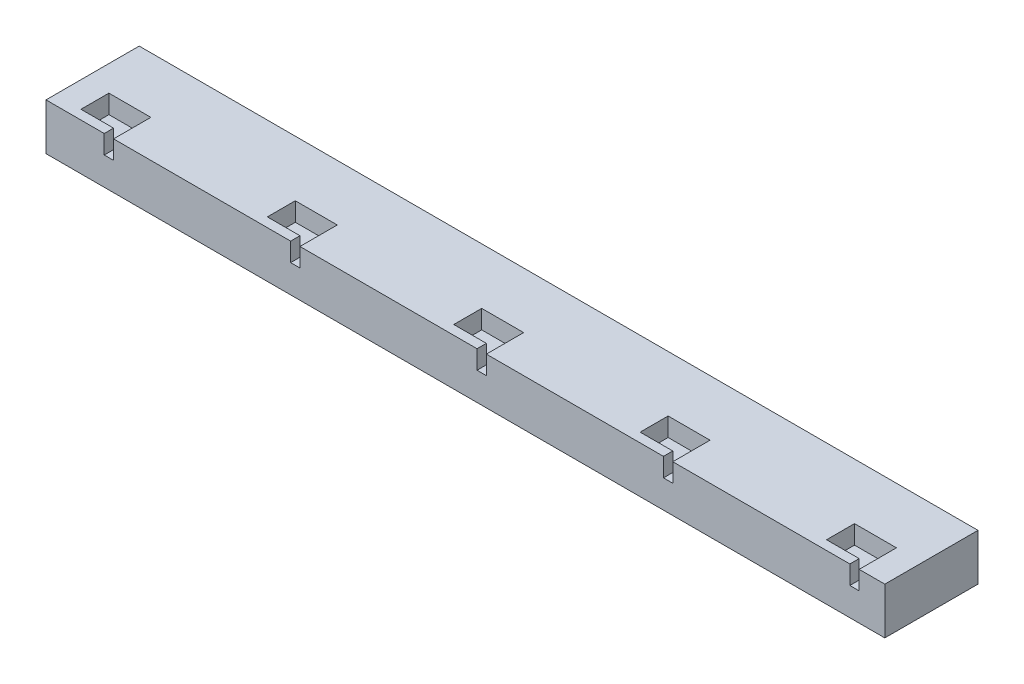
ISO-10303-21;
HEADER;
FILE_DESCRIPTION(('STEP AP214'),'2;1');
FILE_NAME('part.step','',(''),(''),'','','');
FILE_SCHEMA(('AUTOMOTIVE_DESIGN { 1 0 10303 214 1 1 1 1 }'));
ENDSEC;
DATA;
#1=APPLICATION_CONTEXT('core data for automotive mechanical design processes');
#2=APPLICATION_PROTOCOL_DEFINITION('international standard','automotive_design',2000,#1);
#3=PRODUCT_CONTEXT('',#1,'mechanical');
#4=PRODUCT('Part','Part','',(#3));
#5=PRODUCT_RELATED_PRODUCT_CATEGORY('part','',(#4));
#6=PRODUCT_DEFINITION_FORMATION('','',#4);
#7=PRODUCT_DEFINITION_CONTEXT('part definition',#1,'design');
#8=PRODUCT_DEFINITION('design','',#6,#7);
#9=PRODUCT_DEFINITION_SHAPE('','',#8);
#10=(LENGTH_UNIT() NAMED_UNIT(*) SI_UNIT(.MILLI.,.METRE.));
#11=(NAMED_UNIT(*) PLANE_ANGLE_UNIT() SI_UNIT($,.RADIAN.));
#12=(NAMED_UNIT(*) SI_UNIT($,.STERADIAN.) SOLID_ANGLE_UNIT());
#13=UNCERTAINTY_MEASURE_WITH_UNIT(LENGTH_MEASURE(1.E-05),#10,'distance_accuracy_value','');
#14=(GEOMETRIC_REPRESENTATION_CONTEXT(3) GLOBAL_UNCERTAINTY_ASSIGNED_CONTEXT((#13)) GLOBAL_UNIT_ASSIGNED_CONTEXT((#10,
#11,#12)) REPRESENTATION_CONTEXT('',''));
#15=CARTESIAN_POINT('',(0.,0.,0.));
#16=DIRECTION('',(0.,0.,1.));
#17=DIRECTION('',(1.,0.,0.));
#18=AXIS2_PLACEMENT_3D('',#15,#16,#17);
#19=CARTESIAN_POINT('',(90.0000000000001,10.,10.));
#20=DIRECTION('',(-1.,0.,0.));
#21=DIRECTION('',(0.,0.,1.));
#22=AXIS2_PLACEMENT_3D('',#19,#20,#21);
#23=PLANE('',#22);
#24=DIRECTION('',(0.,0.,-1.));
#25=VECTOR('',#24,1.);
#26=CARTESIAN_POINT('',(90.0000000000001,0.,10.));
#27=LINE('',#26,#25);
#28=CARTESIAN_POINT('',(90.0000000000001,0.,10.));
#29=VERTEX_POINT('',#28);
#30=CARTESIAN_POINT('',(90.0000000000001,0.,-10.));
#31=VERTEX_POINT('',#30);
#32=EDGE_CURVE('E467',#29,#31,#27,.T.);
#33=ORIENTED_EDGE('',*,*,#32,.T.);
#34=DIRECTION('',(0.,-1.,0.));
#35=VECTOR('',#34,1.);
#36=CARTESIAN_POINT('',(90.0000000000001,10.,-10.));
#37=LINE('',#36,#35);
#38=CARTESIAN_POINT('',(90.0000000000001,10.,-10.));
#39=VERTEX_POINT('',#38);
#40=EDGE_CURVE('E11',#39,#31,#37,.T.);
#41=ORIENTED_EDGE('',*,*,#40,.F.);
#42=DIRECTION('',(0.,0.,-1.));
#43=VECTOR('',#42,1.);
#44=CARTESIAN_POINT('',(90.0000000000001,10.,10.));
#45=LINE('',#44,#43);
#46=CARTESIAN_POINT('',(90.0000000000001,10.,10.));
#47=VERTEX_POINT('',#46);
#48=EDGE_CURVE('E479',#47,#39,#45,.T.);
#49=ORIENTED_EDGE('',*,*,#48,.F.);
#50=DIRECTION('',(0.,-1.,0.));
#51=VECTOR('',#50,1.);
#52=CARTESIAN_POINT('',(90.0000000000001,10.,10.));
#53=LINE('',#52,#51);
#54=EDGE_CURVE('E491',#47,#29,#53,.T.);
#55=ORIENTED_EDGE('',*,*,#54,.T.);
#56=EDGE_LOOP('',(#33,#41,#49,#55));
#57=FACE_BOUND('',#56,.T.);
#58=ADVANCED_FACE('F41',(#57),#23,.F.);
#59=CARTESIAN_POINT('',(-89.9999999999999,10.,-10.));
#60=DIRECTION('',(0.,0.,1.));
#61=DIRECTION('',(1.,0.,0.));
#62=AXIS2_PLACEMENT_3D('',#59,#60,#61);
#63=PLANE('',#62);
#64=DIRECTION('',(-1.,0.,0.));
#65=VECTOR('',#64,1.);
#66=CARTESIAN_POINT('',(-89.9999999999999,0.,-10.));
#67=LINE('',#66,#65);
#68=CARTESIAN_POINT('',(-89.9999999999999,0.,-10.));
#69=VERTEX_POINT('',#68);
#70=EDGE_CURVE('E495',#31,#69,#67,.T.);
#71=ORIENTED_EDGE('',*,*,#70,.T.);
#72=DIRECTION('',(0.,-1.,0.));
#73=VECTOR('',#72,1.);
#74=CARTESIAN_POINT('',(-89.9999999999999,10.,-10.));
#75=LINE('',#74,#73);
#76=CARTESIAN_POINT('',(-89.9999999999999,10.,-10.));
#77=VERTEX_POINT('',#76);
#78=EDGE_CURVE('E48',#77,#69,#75,.T.);
#79=ORIENTED_EDGE('',*,*,#78,.F.);
#80=DIRECTION('',(-1.,0.,0.));
#81=VECTOR('',#80,1.);
#82=CARTESIAN_POINT('',(-89.9999999999999,10.,-10.));
#83=LINE('',#82,#81);
#84=EDGE_CURVE('E482',#39,#77,#83,.T.);
#85=ORIENTED_EDGE('',*,*,#84,.F.);
#86=ORIENTED_EDGE('',*,*,#40,.T.);
#87=EDGE_LOOP('',(#71,#79,#85,#86));
#88=FACE_BOUND('',#87,.T.);
#89=ADVANCED_FACE('F641',(#88),#63,.F.);
#90=CARTESIAN_POINT('',(-89.9999999999999,10.,10.));
#91=DIRECTION('',(1.,0.,0.));
#92=DIRECTION('',(0.,0.,-1.));
#93=AXIS2_PLACEMENT_3D('',#90,#91,#92);
#94=PLANE('',#93);
#95=DIRECTION('',(0.,0.,1.));
#96=VECTOR('',#95,1.);
#97=CARTESIAN_POINT('',(-89.9999999999999,0.,10.));
#98=LINE('',#97,#96);
#99=CARTESIAN_POINT('',(-89.9999999999999,0.,10.));
#100=VERTEX_POINT('',#99);
#101=EDGE_CURVE('E497',#69,#100,#98,.T.);
#102=ORIENTED_EDGE('',*,*,#101,.T.);
#103=DIRECTION('',(0.,-1.,0.));
#104=VECTOR('',#103,1.);
#105=CARTESIAN_POINT('',(-89.9999999999999,10.,10.));
#106=LINE('',#105,#104);
#107=CARTESIAN_POINT('',(-89.9999999999999,10.,10.));
#108=VERTEX_POINT('',#107);
#109=EDGE_CURVE('E502',#108,#100,#106,.T.);
#110=ORIENTED_EDGE('',*,*,#109,.F.);
#111=DIRECTION('',(0.,0.,1.));
#112=VECTOR('',#111,1.);
#113=CARTESIAN_POINT('',(-89.9999999999999,10.,10.));
#114=LINE('',#113,#112);
#115=EDGE_CURVE('E485',#77,#108,#114,.T.);
#116=ORIENTED_EDGE('',*,*,#115,.F.);
#117=ORIENTED_EDGE('',*,*,#78,.T.);
#118=EDGE_LOOP('',(#102,#110,#116,#117));
#119=FACE_BOUND('',#118,.T.);
#120=ADVANCED_FACE('F509',(#119),#94,.F.);
#121=CARTESIAN_POINT('',(-89.9999999999999,10.,10.));
#122=DIRECTION('',(0.,0.,-1.));
#123=DIRECTION('',(-1.,0.,0.));
#124=AXIS2_PLACEMENT_3D('',#121,#122,#123);
#125=PLANE('',#124);
#126=DIRECTION('',(1.,0.,0.));
#127=VECTOR('',#126,1.);
#128=CARTESIAN_POINT('',(-89.9999999999999,10.,10.));
#129=LINE('',#128,#127);
#130=CARTESIAN_POINT('',(-75.5,10.,10.0000000000011));
#131=VERTEX_POINT('',#130);
#132=CARTESIAN_POINT('',(-37.5,10.,10.0000000000008));
#133=VERTEX_POINT('',#132);
#134=EDGE_CURVE('E492',#131,#133,#129,.T.);
#135=ORIENTED_EDGE('',*,*,#134,.F.);
#136=DIRECTION('',(0.,1.,0.));
#137=VECTOR('',#136,1.);
#138=CARTESIAN_POINT('',(-75.5,6.,10.0000000000011));
#139=LINE('',#138,#137);
#140=CARTESIAN_POINT('',(-75.5,6.,10.0000000000011));
#141=VERTEX_POINT('',#140);
#142=EDGE_CURVE('E405',#141,#131,#139,.T.);
#143=ORIENTED_EDGE('',*,*,#142,.F.);
#144=DIRECTION('',(1.,0.,0.));
#145=VECTOR('',#144,1.);
#146=CARTESIAN_POINT('',(-75.5,6.,10.0000000000011));
#147=LINE('',#146,#145);
#148=CARTESIAN_POINT('',(-77.5,6.,10.0000000000011));
#149=VERTEX_POINT('',#148);
#150=EDGE_CURVE('E423',#149,#141,#147,.T.);
#151=ORIENTED_EDGE('',*,*,#150,.F.);
#152=DIRECTION('',(0.,1.,0.));
#153=VECTOR('',#152,1.);
#154=CARTESIAN_POINT('',(-77.5,6.,10.0000000000011));
#155=LINE('',#154,#153);
#156=CARTESIAN_POINT('',(-77.5,10.,10.0000000000011));
#157=VERTEX_POINT('',#156);
#158=EDGE_CURVE('E402',#149,#157,#155,.T.);
#159=ORIENTED_EDGE('',*,*,#158,.T.);
#160=EDGE_CURVE('E488',#108,#157,#129,.T.);
#161=ORIENTED_EDGE('',*,*,#160,.F.);
#162=ORIENTED_EDGE('',*,*,#109,.T.);
#163=DIRECTION('',(1.,0.,0.));
#164=VECTOR('',#163,1.);
#165=CARTESIAN_POINT('',(-89.9999999999999,0.,10.));
#166=LINE('',#165,#164);
#167=EDGE_CURVE('E483',#100,#29,#166,.T.);
#168=ORIENTED_EDGE('',*,*,#167,.T.);
#169=ORIENTED_EDGE('',*,*,#54,.F.);
#170=CARTESIAN_POINT('',(84.5,10.,10.));
#171=VERTEX_POINT('',#170);
#172=EDGE_CURVE('E487',#171,#47,#129,.T.);
#173=ORIENTED_EDGE('',*,*,#172,.F.);
#174=DIRECTION('',(0.,1.,0.));
#175=VECTOR('',#174,1.);
#176=CARTESIAN_POINT('',(84.5,6.,10.));
#177=LINE('',#176,#175);
#178=CARTESIAN_POINT('',(84.5,6.,10.));
#179=VERTEX_POINT('',#178);
#180=EDGE_CURVE('E270',#179,#171,#177,.T.);
#181=ORIENTED_EDGE('',*,*,#180,.F.);
#182=DIRECTION('',(1.,0.,0.));
#183=VECTOR('',#182,1.);
#184=CARTESIAN_POINT('',(84.5,6.,10.));
#185=LINE('',#184,#183);
#186=CARTESIAN_POINT('',(82.5,6.,10.));
#187=VERTEX_POINT('',#186);
#188=EDGE_CURVE('E296',#187,#179,#185,.T.);
#189=ORIENTED_EDGE('',*,*,#188,.F.);
#190=DIRECTION('',(0.,1.,0.));
#191=VECTOR('',#190,1.);
#192=CARTESIAN_POINT('',(82.5,6.,10.));
#193=LINE('',#192,#191);
#194=CARTESIAN_POINT('',(82.5,10.,10.));
#195=VERTEX_POINT('',#194);
#196=EDGE_CURVE('E610',#187,#195,#193,.T.);
#197=ORIENTED_EDGE('',*,*,#196,.T.);
#198=CARTESIAN_POINT('',(44.5,10.,10.0000000000003));
#199=VERTEX_POINT('',#198);
#200=EDGE_CURVE('E524',#199,#195,#129,.T.);
#201=ORIENTED_EDGE('',*,*,#200,.F.);
#202=DIRECTION('',(0.,1.,0.));
#203=VECTOR('',#202,1.);
#204=CARTESIAN_POINT('',(44.5,6.,10.0000000000003));
#205=LINE('',#204,#203);
#206=CARTESIAN_POINT('',(44.5,6.,10.0000000000003));
#207=VERTEX_POINT('',#206);
#208=EDGE_CURVE('E468',#207,#199,#205,.T.);
#209=ORIENTED_EDGE('',*,*,#208,.F.);
#210=DIRECTION('',(1.,0.,0.));
#211=VECTOR('',#210,1.);
#212=CARTESIAN_POINT('',(44.5,6.,10.0000000000003));
#213=LINE('',#212,#211);
#214=CARTESIAN_POINT('',(42.5,6.,10.0000000000003));
#215=VERTEX_POINT('',#214);
#216=EDGE_CURVE('E450',#215,#207,#213,.T.);
#217=ORIENTED_EDGE('',*,*,#216,.F.);
#218=DIRECTION('',(0.,1.,0.));
#219=VECTOR('',#218,1.);
#220=CARTESIAN_POINT('',(42.5,6.,10.0000000000003));
#221=LINE('',#220,#219);
#222=CARTESIAN_POINT('',(42.5,10.,10.0000000000003));
#223=VERTEX_POINT('',#222);
#224=EDGE_CURVE('E470',#215,#223,#221,.T.);
#225=ORIENTED_EDGE('',*,*,#224,.T.);
#226=CARTESIAN_POINT('',(4.50000000000002,10.,10.0000000000006));
#227=VERTEX_POINT('',#226);
#228=EDGE_CURVE('E526',#227,#223,#129,.T.);
#229=ORIENTED_EDGE('',*,*,#228,.F.);
#230=DIRECTION('',(0.,1.,0.));
#231=VECTOR('',#230,1.);
#232=CARTESIAN_POINT('',(4.50000000000002,6.,10.0000000000006));
#233=LINE('',#232,#231);
#234=CARTESIAN_POINT('',(4.50000000000002,6.,10.0000000000006));
#235=VERTEX_POINT('',#234);
#236=EDGE_CURVE('E321',#235,#227,#233,.T.);
#237=ORIENTED_EDGE('',*,*,#236,.F.);
#238=DIRECTION('',(1.,0.,0.));
#239=VECTOR('',#238,1.);
#240=CARTESIAN_POINT('',(4.50000000000002,6.,10.0000000000006));
#241=LINE('',#240,#239);
#242=CARTESIAN_POINT('',(2.50000000000002,6.,10.0000000000006));
#243=VERTEX_POINT('',#242);
#244=EDGE_CURVE('E339',#243,#235,#241,.T.);
#245=ORIENTED_EDGE('',*,*,#244,.F.);
#246=DIRECTION('',(0.,1.,0.));
#247=VECTOR('',#246,1.);
#248=CARTESIAN_POINT('',(2.50000000000002,6.,10.0000000000006));
#249=LINE('',#248,#247);
#250=CARTESIAN_POINT('',(2.50000000000002,10.,10.0000000000006));
#251=VERTEX_POINT('',#250);
#252=EDGE_CURVE('E318',#243,#251,#249,.T.);
#253=ORIENTED_EDGE('',*,*,#252,.T.);
#254=CARTESIAN_POINT('',(-35.5,10.,10.0000000000008));
#255=VERTEX_POINT('',#254);
#256=EDGE_CURVE('E531',#255,#251,#129,.T.);
#257=ORIENTED_EDGE('',*,*,#256,.F.);
#258=DIRECTION('',(0.,1.,0.));
#259=VECTOR('',#258,1.);
#260=CARTESIAN_POINT('',(-35.5,6.,10.0000000000008));
#261=LINE('',#260,#259);
#262=CARTESIAN_POINT('',(-35.5,6.,10.0000000000008));
#263=VERTEX_POINT('',#262);
#264=EDGE_CURVE('E363',#263,#255,#261,.T.);
#265=ORIENTED_EDGE('',*,*,#264,.F.);
#266=DIRECTION('',(1.,0.,0.));
#267=VECTOR('',#266,1.);
#268=CARTESIAN_POINT('',(-35.5,6.,10.0000000000008));
#269=LINE('',#268,#267);
#270=CARTESIAN_POINT('',(-37.5,6.,10.0000000000008));
#271=VERTEX_POINT('',#270);
#272=EDGE_CURVE('E381',#271,#263,#269,.T.);
#273=ORIENTED_EDGE('',*,*,#272,.F.);
#274=DIRECTION('',(0.,1.,0.));
#275=VECTOR('',#274,1.);
#276=CARTESIAN_POINT('',(-37.5,6.,10.0000000000008));
#277=LINE('',#276,#275);
#278=EDGE_CURVE('E360',#271,#133,#277,.T.);
#279=ORIENTED_EDGE('',*,*,#278,.T.);
#280=EDGE_LOOP('',(#135,#143,#151,#159,#161,#162,#168,#169,#173,#181,#189,#197,#201,#209,#217,
#225,#229,#237,#245,#253,#257,#265,#273,#279));
#281=FACE_BOUND('',#280,.T.);
#282=ADVANCED_FACE('F519',(#281),#125,.F.);
#283=CARTESIAN_POINT('',(0.,10.,0.));
#284=DIRECTION('',(0.,-1.,0.));
#285=DIRECTION('',(0.,0.,-1.));
#286=AXIS2_PLACEMENT_3D('',#283,#284,#285);
#287=PLANE('',#286);
#288=DIRECTION('',(-1.,0.,0.));
#289=VECTOR('',#288,1.);
#290=CARTESIAN_POINT('',(-75.5,10.,2.00000000000112));
#291=LINE('',#290,#289);
#292=CARTESIAN_POINT('',(-75.5,10.,2.00000000000112));
#293=VERTEX_POINT('',#292);
#294=CARTESIAN_POINT('',(-84.5,10.,2.00000000000112));
#295=VERTEX_POINT('',#294);
#296=EDGE_CURVE('E55',#293,#295,#291,.T.);
#297=ORIENTED_EDGE('',*,*,#296,.F.);
#298=DIRECTION('',(0.,0.,-1.));
#299=VECTOR('',#298,1.);
#300=CARTESIAN_POINT('',(-75.5,10.,2.00000000000112));
#301=LINE('',#300,#299);
#302=EDGE_CURVE('E409',#131,#293,#301,.T.);
#303=ORIENTED_EDGE('',*,*,#302,.F.);
#304=ORIENTED_EDGE('',*,*,#134,.T.);
#305=DIRECTION('',(0.,0.,1.));
#306=VECTOR('',#305,1.);
#307=CARTESIAN_POINT('',(-37.5,10.,8.0000000000014));
#308=LINE('',#307,#306);
#309=CARTESIAN_POINT('',(-37.5,10.,8.0000000000014));
#310=VERTEX_POINT('',#309);
#311=EDGE_CURVE('E370',#310,#133,#308,.T.);
#312=ORIENTED_EDGE('',*,*,#311,.F.);
#313=DIRECTION('',(1.,0.,0.));
#314=VECTOR('',#313,1.);
#315=CARTESIAN_POINT('',(-37.5,10.,8.0000000000014));
#316=LINE('',#315,#314);
#317=CARTESIAN_POINT('',(-44.5,10.,8.0000000000014));
#318=VERTEX_POINT('',#317);
#319=EDGE_CURVE('E373',#318,#310,#316,.T.);
#320=ORIENTED_EDGE('',*,*,#319,.F.);
#321=DIRECTION('',(0.,0.,1.));
#322=VECTOR('',#321,1.);
#323=CARTESIAN_POINT('',(-44.5,10.,2.00000000000084));
#324=LINE('',#323,#322);
#325=CARTESIAN_POINT('',(-44.5,10.,2.00000000000084));
#326=VERTEX_POINT('',#325);
#327=EDGE_CURVE('E376',#326,#318,#324,.T.);
#328=ORIENTED_EDGE('',*,*,#327,.F.);
#329=DIRECTION('',(-1.,0.,0.));
#330=VECTOR('',#329,1.);
#331=CARTESIAN_POINT('',(-35.5,10.,2.00000000000084));
#332=LINE('',#331,#330);
#333=CARTESIAN_POINT('',(-35.5,10.,2.00000000000084));
#334=VERTEX_POINT('',#333);
#335=EDGE_CURVE('E63',#334,#326,#332,.T.);
#336=ORIENTED_EDGE('',*,*,#335,.F.);
#337=DIRECTION('',(0.,0.,-1.));
#338=VECTOR('',#337,1.);
#339=CARTESIAN_POINT('',(-35.5,10.,2.00000000000084));
#340=LINE('',#339,#338);
#341=EDGE_CURVE('E367',#255,#334,#340,.T.);
#342=ORIENTED_EDGE('',*,*,#341,.F.);
#343=ORIENTED_EDGE('',*,*,#256,.T.);
#344=DIRECTION('',(0.,0.,1.));
#345=VECTOR('',#344,1.);
#346=CARTESIAN_POINT('',(2.50000000000002,10.,8.00000000000112));
#347=LINE('',#346,#345);
#348=CARTESIAN_POINT('',(2.50000000000002,10.,8.00000000000112));
#349=VERTEX_POINT('',#348);
#350=EDGE_CURVE('E328',#349,#251,#347,.T.);
#351=ORIENTED_EDGE('',*,*,#350,.F.);
#352=DIRECTION('',(1.,0.,0.));
#353=VECTOR('',#352,1.);
#354=CARTESIAN_POINT('',(2.50000000000002,10.,8.00000000000112));
#355=LINE('',#354,#353);
#356=CARTESIAN_POINT('',(-4.49999999999999,10.,8.00000000000112));
#357=VERTEX_POINT('',#356);
#358=EDGE_CURVE('E331',#357,#349,#355,.T.);
#359=ORIENTED_EDGE('',*,*,#358,.F.);
#360=DIRECTION('',(0.,0.,1.));
#361=VECTOR('',#360,1.);
#362=CARTESIAN_POINT('',(-4.49999999999999,10.,2.00000000000056));
#363=LINE('',#362,#361);
#364=CARTESIAN_POINT('',(-4.49999999999999,10.,2.00000000000056));
#365=VERTEX_POINT('',#364);
#366=EDGE_CURVE('E334',#365,#357,#363,.T.);
#367=ORIENTED_EDGE('',*,*,#366,.F.);
#368=DIRECTION('',(-1.,0.,0.));
#369=VECTOR('',#368,1.);
#370=CARTESIAN_POINT('',(4.50000000000002,10.,2.00000000000056));
#371=LINE('',#370,#369);
#372=CARTESIAN_POINT('',(4.50000000000002,10.,2.00000000000056));
#373=VERTEX_POINT('',#372);
#374=EDGE_CURVE('E271',#373,#365,#371,.T.);
#375=ORIENTED_EDGE('',*,*,#374,.F.);
#376=DIRECTION('',(0.,0.,-1.));
#377=VECTOR('',#376,1.);
#378=CARTESIAN_POINT('',(4.50000000000002,10.,2.00000000000056));
#379=LINE('',#378,#377);
#380=EDGE_CURVE('E325',#227,#373,#379,.T.);
#381=ORIENTED_EDGE('',*,*,#380,.F.);
#382=ORIENTED_EDGE('',*,*,#228,.T.);
#383=DIRECTION('',(0.,0.,1.));
#384=VECTOR('',#383,1.);
#385=CARTESIAN_POINT('',(42.5,10.,8.00000000000084));
#386=LINE('',#385,#384);
#387=CARTESIAN_POINT('',(42.5,10.,8.00000000000084));
#388=VERTEX_POINT('',#387);
#389=EDGE_CURVE('E461',#388,#223,#386,.T.);
#390=ORIENTED_EDGE('',*,*,#389,.F.);
#391=DIRECTION('',(1.,0.,0.));
#392=VECTOR('',#391,1.);
#393=CARTESIAN_POINT('',(42.5,10.,8.00000000000084));
#394=LINE('',#393,#392);
#395=CARTESIAN_POINT('',(35.5,10.,8.00000000000084));
#396=VERTEX_POINT('',#395);
#397=EDGE_CURVE('E458',#396,#388,#394,.T.);
#398=ORIENTED_EDGE('',*,*,#397,.F.);
#399=DIRECTION('',(0.,0.,1.));
#400=VECTOR('',#399,1.);
#401=CARTESIAN_POINT('',(35.5,10.,2.00000000000028));
#402=LINE('',#401,#400);
#403=CARTESIAN_POINT('',(35.5,10.,2.00000000000028));
#404=VERTEX_POINT('',#403);
#405=EDGE_CURVE('E288',#404,#396,#402,.T.);
#406=ORIENTED_EDGE('',*,*,#405,.F.);
#407=DIRECTION('',(-1.,0.,0.));
#408=VECTOR('',#407,1.);
#409=CARTESIAN_POINT('',(44.5,10.,2.00000000000028));
#410=LINE('',#409,#408);
#411=CARTESIAN_POINT('',(44.5,10.,2.00000000000028));
#412=VERTEX_POINT('',#411);
#413=EDGE_CURVE('E286',#412,#404,#410,.T.);
#414=ORIENTED_EDGE('',*,*,#413,.F.);
#415=DIRECTION('',(0.,0.,-1.));
#416=VECTOR('',#415,1.);
#417=CARTESIAN_POINT('',(44.5,10.,2.00000000000028));
#418=LINE('',#417,#416);
#419=EDGE_CURVE('E441',#199,#412,#418,.T.);
#420=ORIENTED_EDGE('',*,*,#419,.F.);
#421=ORIENTED_EDGE('',*,*,#200,.T.);
#422=DIRECTION('',(0.,0.,1.));
#423=VECTOR('',#422,1.);
#424=CARTESIAN_POINT('',(82.5,10.,8.00000000000056));
#425=LINE('',#424,#423);
#426=CARTESIAN_POINT('',(82.5,10.,8.00000000000056));
#427=VERTEX_POINT('',#426);
#428=EDGE_CURVE('E279',#427,#195,#425,.T.);
#429=ORIENTED_EDGE('',*,*,#428,.F.);
#430=DIRECTION('',(1.,0.,0.));
#431=VECTOR('',#430,1.);
#432=CARTESIAN_POINT('',(82.5,10.,8.00000000000056));
#433=LINE('',#432,#431);
#434=CARTESIAN_POINT('',(75.5,10.,8.00000000000056));
#435=VERTEX_POINT('',#434);
#436=EDGE_CURVE('E290',#435,#427,#433,.T.);
#437=ORIENTED_EDGE('',*,*,#436,.F.);
#438=DIRECTION('',(0.,0.,1.));
#439=VECTOR('',#438,1.);
#440=CARTESIAN_POINT('',(75.5,10.,2.));
#441=LINE('',#440,#439);
#442=CARTESIAN_POINT('',(75.5,10.,2.));
#443=VERTEX_POINT('',#442);
#444=EDGE_CURVE('E285',#443,#435,#441,.T.);
#445=ORIENTED_EDGE('',*,*,#444,.F.);
#446=DIRECTION('',(-1.,0.,0.));
#447=VECTOR('',#446,1.);
#448=CARTESIAN_POINT('',(84.5,10.,2.));
#449=LINE('',#448,#447);
#450=CARTESIAN_POINT('',(84.5,10.,2.));
#451=VERTEX_POINT('',#450);
#452=EDGE_CURVE('E265',#451,#443,#449,.T.);
#453=ORIENTED_EDGE('',*,*,#452,.F.);
#454=DIRECTION('',(0.,0.,-1.));
#455=VECTOR('',#454,1.);
#456=CARTESIAN_POINT('',(84.5,10.,2.));
#457=LINE('',#456,#455);
#458=EDGE_CURVE('E274',#171,#451,#457,.T.);
#459=ORIENTED_EDGE('',*,*,#458,.F.);
#460=ORIENTED_EDGE('',*,*,#172,.T.);
#461=ORIENTED_EDGE('',*,*,#48,.T.);
#462=ORIENTED_EDGE('',*,*,#84,.T.);
#463=ORIENTED_EDGE('',*,*,#115,.T.);
#464=ORIENTED_EDGE('',*,*,#160,.T.);
#465=DIRECTION('',(0.,0.,1.));
#466=VECTOR('',#465,1.);
#467=CARTESIAN_POINT('',(-77.5,10.,8.00000000000168));
#468=LINE('',#467,#466);
#469=CARTESIAN_POINT('',(-77.5,10.,8.00000000000168));
#470=VERTEX_POINT('',#469);
#471=EDGE_CURVE('E412',#470,#157,#468,.T.);
#472=ORIENTED_EDGE('',*,*,#471,.F.);
#473=DIRECTION('',(1.,0.,0.));
#474=VECTOR('',#473,1.);
#475=CARTESIAN_POINT('',(-77.5,10.,8.00000000000168));
#476=LINE('',#475,#474);
#477=CARTESIAN_POINT('',(-84.5,10.,8.00000000000168));
#478=VERTEX_POINT('',#477);
#479=EDGE_CURVE('E415',#478,#470,#476,.T.);
#480=ORIENTED_EDGE('',*,*,#479,.F.);
#481=DIRECTION('',(0.,0.,1.));
#482=VECTOR('',#481,1.);
#483=CARTESIAN_POINT('',(-84.5,10.,2.00000000000112));
#484=LINE('',#483,#482);
#485=EDGE_CURVE('E418',#295,#478,#484,.T.);
#486=ORIENTED_EDGE('',*,*,#485,.F.);
#487=EDGE_LOOP('',(#297,#303,#304,#312,#320,#328,#336,#342,#343,#351,#359,#367,#375,#381,#382,
#390,#398,#406,#414,#420,#421,#429,#437,#445,#453,#459,#460,#461,#462,#463,#464,#472,#480,#486));
#488=FACE_BOUND('',#487,.T.);
#489=ADVANCED_FACE('F282',(#488),#287,.F.);
#490=CARTESIAN_POINT('',(0.,0.,0.));
#491=DIRECTION('',(0.,-1.,0.));
#492=DIRECTION('',(0.,0.,-1.));
#493=AXIS2_PLACEMENT_3D('',#490,#491,#492);
#494=PLANE('',#493);
#495=ORIENTED_EDGE('',*,*,#32,.F.);
#496=ORIENTED_EDGE('',*,*,#167,.F.);
#497=ORIENTED_EDGE('',*,*,#101,.F.);
#498=ORIENTED_EDGE('',*,*,#70,.F.);
#499=EDGE_LOOP('',(#495,#496,#497,#498));
#500=FACE_BOUND('',#499,.T.);
#501=ADVANCED_FACE('F515',(#500),#494,.T.);
#502=CARTESIAN_POINT('',(44.5,6.,2.00000000000028));
#503=DIRECTION('',(0.,0.,-1.));
#504=DIRECTION('',(-1.,0.,0.));
#505=AXIS2_PLACEMENT_3D('',#502,#503,#504);
#506=PLANE('',#505);
#507=ORIENTED_EDGE('',*,*,#413,.T.);
#508=DIRECTION('',(0.,1.,0.));
#509=VECTOR('',#508,1.);
#510=CARTESIAN_POINT('',(35.5,6.,2.00000000000028));
#511=LINE('',#510,#509);
#512=CARTESIAN_POINT('',(35.5,6.,2.00000000000028));
#513=VERTEX_POINT('',#512);
#514=EDGE_CURVE('E454',#513,#404,#511,.T.);
#515=ORIENTED_EDGE('',*,*,#514,.F.);
#516=DIRECTION('',(-1.,0.,0.));
#517=VECTOR('',#516,1.);
#518=CARTESIAN_POINT('',(44.5,6.,2.00000000000028));
#519=LINE('',#518,#517);
#520=CARTESIAN_POINT('',(44.5,6.,2.00000000000028));
#521=VERTEX_POINT('',#520);
#522=EDGE_CURVE('E437',#521,#513,#519,.T.);
#523=ORIENTED_EDGE('',*,*,#522,.F.);
#524=DIRECTION('',(0.,1.,0.));
#525=VECTOR('',#524,1.);
#526=CARTESIAN_POINT('',(44.5,6.,2.00000000000028));
#527=LINE('',#526,#525);
#528=EDGE_CURVE('E465',#521,#412,#527,.T.);
#529=ORIENTED_EDGE('',*,*,#528,.T.);
#530=EDGE_LOOP('',(#507,#515,#523,#529));
#531=FACE_BOUND('',#530,.T.);
#532=ADVANCED_FACE('F604',(#531),#506,.F.);
#533=CARTESIAN_POINT('',(44.5,6.,2.00000000000028));
#534=DIRECTION('',(1.,0.,0.));
#535=DIRECTION('',(0.,0.,-1.));
#536=AXIS2_PLACEMENT_3D('',#533,#534,#535);
#537=PLANE('',#536);
#538=ORIENTED_EDGE('',*,*,#419,.T.);
#539=ORIENTED_EDGE('',*,*,#528,.F.);
#540=DIRECTION('',(0.,0.,-1.));
#541=VECTOR('',#540,1.);
#542=CARTESIAN_POINT('',(44.5,6.,7.78134066468021));
#543=LINE('',#542,#541);
#544=EDGE_CURVE('E453',#207,#521,#543,.T.);
#545=ORIENTED_EDGE('',*,*,#544,.F.);
#546=ORIENTED_EDGE('',*,*,#208,.T.);
#547=EDGE_LOOP('',(#538,#539,#545,#546));
#548=FACE_BOUND('',#547,.T.);
#549=ADVANCED_FACE('F607',(#548),#537,.F.);
#550=CARTESIAN_POINT('',(42.5,6.,8.00000000000084));
#551=DIRECTION('',(-1.,0.,0.));
#552=DIRECTION('',(0.,0.,1.));
#553=AXIS2_PLACEMENT_3D('',#550,#551,#552);
#554=PLANE('',#553);
#555=ORIENTED_EDGE('',*,*,#389,.T.);
#556=ORIENTED_EDGE('',*,*,#224,.F.);
#557=DIRECTION('',(0.,0.,1.));
#558=VECTOR('',#557,1.);
#559=CARTESIAN_POINT('',(42.5,6.,8.00000000000084));
#560=LINE('',#559,#558);
#561=CARTESIAN_POINT('',(42.5,6.,8.00000000000084));
#562=VERTEX_POINT('',#561);
#563=EDGE_CURVE('E447',#562,#215,#560,.T.);
#564=ORIENTED_EDGE('',*,*,#563,.F.);
#565=DIRECTION('',(0.,1.,0.));
#566=VECTOR('',#565,1.);
#567=CARTESIAN_POINT('',(42.5,6.,8.00000000000084));
#568=LINE('',#567,#566);
#569=EDGE_CURVE('E473',#562,#388,#568,.T.);
#570=ORIENTED_EDGE('',*,*,#569,.T.);
#571=EDGE_LOOP('',(#555,#556,#564,#570));
#572=FACE_BOUND('',#571,.T.);
#573=ADVANCED_FACE('F590',(#572),#554,.F.);
#574=CARTESIAN_POINT('',(42.5,6.,8.00000000000084));
#575=DIRECTION('',(0.,0.,1.));
#576=DIRECTION('',(1.,0.,0.));
#577=AXIS2_PLACEMENT_3D('',#574,#575,#576);
#578=PLANE('',#577);
#579=ORIENTED_EDGE('',*,*,#397,.T.);
#580=ORIENTED_EDGE('',*,*,#569,.F.);
#581=DIRECTION('',(1.,0.,0.));
#582=VECTOR('',#581,1.);
#583=CARTESIAN_POINT('',(42.5,6.,8.00000000000084));
#584=LINE('',#583,#582);
#585=CARTESIAN_POINT('',(35.5,6.,8.00000000000084));
#586=VERTEX_POINT('',#585);
#587=EDGE_CURVE('E444',#586,#562,#584,.T.);
#588=ORIENTED_EDGE('',*,*,#587,.F.);
#589=DIRECTION('',(0.,1.,0.));
#590=VECTOR('',#589,1.);
#591=CARTESIAN_POINT('',(35.5,6.,8.00000000000084));
#592=LINE('',#591,#590);
#593=EDGE_CURVE('E475',#586,#396,#592,.T.);
#594=ORIENTED_EDGE('',*,*,#593,.T.);
#595=EDGE_LOOP('',(#579,#580,#588,#594));
#596=FACE_BOUND('',#595,.T.);
#597=ADVANCED_FACE('F596',(#596),#578,.F.);
#598=CARTESIAN_POINT('',(35.5,6.,2.00000000000028));
#599=DIRECTION('',(-1.,0.,0.));
#600=DIRECTION('',(0.,0.,1.));
#601=AXIS2_PLACEMENT_3D('',#598,#599,#600);
#602=PLANE('',#601);
#603=ORIENTED_EDGE('',*,*,#405,.T.);
#604=ORIENTED_EDGE('',*,*,#593,.F.);
#605=DIRECTION('',(0.,0.,1.));
#606=VECTOR('',#605,1.);
#607=CARTESIAN_POINT('',(35.5,6.,2.00000000000028));
#608=LINE('',#607,#606);
#609=EDGE_CURVE('E440',#513,#586,#608,.T.);
#610=ORIENTED_EDGE('',*,*,#609,.F.);
#611=ORIENTED_EDGE('',*,*,#514,.T.);
#612=EDGE_LOOP('',(#603,#604,#610,#611));
#613=FACE_BOUND('',#612,.T.);
#614=ADVANCED_FACE('F601',(#613),#602,.F.);
#615=CARTESIAN_POINT('',(0.,6.,0.));
#616=DIRECTION('',(0.,1.,0.));
#617=DIRECTION('',(0.,0.,1.));
#618=AXIS2_PLACEMENT_3D('',#615,#616,#617);
#619=PLANE('',#618);
#620=ORIENTED_EDGE('',*,*,#522,.T.);
#621=ORIENTED_EDGE('',*,*,#609,.T.);
#622=ORIENTED_EDGE('',*,*,#587,.T.);
#623=ORIENTED_EDGE('',*,*,#563,.T.);
#624=ORIENTED_EDGE('',*,*,#216,.T.);
#625=ORIENTED_EDGE('',*,*,#544,.T.);
#626=EDGE_LOOP('',(#620,#621,#622,#623,#624,#625));
#627=FACE_BOUND('',#626,.T.);
#628=ADVANCED_FACE('F592',(#627),#619,.T.);
#629=CARTESIAN_POINT('',(84.5,6.,2.));
#630=DIRECTION('',(0.,0.,-1.));
#631=DIRECTION('',(-1.,0.,0.));
#632=AXIS2_PLACEMENT_3D('',#629,#630,#631);
#633=PLANE('',#632);
#634=ORIENTED_EDGE('',*,*,#452,.T.);
#635=DIRECTION('',(0.,1.,0.));
#636=VECTOR('',#635,1.);
#637=CARTESIAN_POINT('',(75.5,6.,2.));
#638=LINE('',#637,#636);
#639=CARTESIAN_POINT('',(75.5,6.,2.));
#640=VERTEX_POINT('',#639);
#641=EDGE_CURVE('E297',#640,#443,#638,.T.);
#642=ORIENTED_EDGE('',*,*,#641,.F.);
#643=DIRECTION('',(-1.,0.,0.));
#644=VECTOR('',#643,1.);
#645=CARTESIAN_POINT('',(84.5,6.,2.));
#646=LINE('',#645,#644);
#647=CARTESIAN_POINT('',(84.5,6.,2.));
#648=VERTEX_POINT('',#647);
#649=EDGE_CURVE('E268',#648,#640,#646,.T.);
#650=ORIENTED_EDGE('',*,*,#649,.F.);
#651=DIRECTION('',(0.,1.,0.));
#652=VECTOR('',#651,1.);
#653=CARTESIAN_POINT('',(84.5,6.,2.));
#654=LINE('',#653,#652);
#655=EDGE_CURVE('E261',#648,#451,#654,.T.);
#656=ORIENTED_EDGE('',*,*,#655,.T.);
#657=EDGE_LOOP('',(#634,#642,#650,#656));
#658=FACE_BOUND('',#657,.T.);
#659=ADVANCED_FACE('F263',(#658),#633,.F.);
#660=CARTESIAN_POINT('',(84.5,6.,2.));
#661=DIRECTION('',(1.,0.,0.));
#662=DIRECTION('',(0.,0.,-1.));
#663=AXIS2_PLACEMENT_3D('',#660,#661,#662);
#664=PLANE('',#663);
#665=ORIENTED_EDGE('',*,*,#458,.T.);
#666=ORIENTED_EDGE('',*,*,#655,.F.);
#667=DIRECTION('',(0.,0.,-1.));
#668=VECTOR('',#667,1.);
#669=CARTESIAN_POINT('',(84.5,6.,7.78134066467997));
#670=LINE('',#669,#668);
#671=EDGE_CURVE('E294',#179,#648,#670,.T.);
#672=ORIENTED_EDGE('',*,*,#671,.F.);
#673=ORIENTED_EDGE('',*,*,#180,.T.);
#674=EDGE_LOOP('',(#665,#666,#672,#673));
#675=FACE_BOUND('',#674,.T.);
#676=ADVANCED_FACE('F275',(#675),#664,.F.);
#677=CARTESIAN_POINT('',(82.5,6.,8.00000000000056));
#678=DIRECTION('',(-1.,0.,0.));
#679=DIRECTION('',(0.,0.,1.));
#680=AXIS2_PLACEMENT_3D('',#677,#678,#679);
#681=PLANE('',#680);
#682=ORIENTED_EDGE('',*,*,#428,.T.);
#683=ORIENTED_EDGE('',*,*,#196,.F.);
#684=DIRECTION('',(0.,0.,1.));
#685=VECTOR('',#684,1.);
#686=CARTESIAN_POINT('',(82.5,6.,8.00000000000056));
#687=LINE('',#686,#685);
#688=CARTESIAN_POINT('',(82.5,6.,8.00000000000056));
#689=VERTEX_POINT('',#688);
#690=EDGE_CURVE('E300',#689,#187,#687,.T.);
#691=ORIENTED_EDGE('',*,*,#690,.F.);
#692=DIRECTION('',(0.,1.,0.));
#693=VECTOR('',#692,1.);
#694=CARTESIAN_POINT('',(82.5,6.,8.00000000000056));
#695=LINE('',#694,#693);
#696=EDGE_CURVE('E613',#689,#427,#695,.T.);
#697=ORIENTED_EDGE('',*,*,#696,.T.);
#698=EDGE_LOOP('',(#682,#683,#691,#697));
#699=FACE_BOUND('',#698,.T.);
#700=ADVANCED_FACE('F624',(#699),#681,.F.);
#701=CARTESIAN_POINT('',(82.5,6.,8.00000000000056));
#702=DIRECTION('',(0.,0.,1.));
#703=DIRECTION('',(1.,0.,0.));
#704=AXIS2_PLACEMENT_3D('',#701,#702,#703);
#705=PLANE('',#704);
#706=ORIENTED_EDGE('',*,*,#436,.T.);
#707=ORIENTED_EDGE('',*,*,#696,.F.);
#708=DIRECTION('',(1.,0.,0.));
#709=VECTOR('',#708,1.);
#710=CARTESIAN_POINT('',(82.5,6.,8.00000000000056));
#711=LINE('',#710,#709);
#712=CARTESIAN_POINT('',(75.5,6.,8.00000000000056));
#713=VERTEX_POINT('',#712);
#714=EDGE_CURVE('E303',#713,#689,#711,.T.);
#715=ORIENTED_EDGE('',*,*,#714,.F.);
#716=DIRECTION('',(0.,1.,0.));
#717=VECTOR('',#716,1.);
#718=CARTESIAN_POINT('',(75.5,6.,8.00000000000056));
#719=LINE('',#718,#717);
#720=EDGE_CURVE('E615',#713,#435,#719,.T.);
#721=ORIENTED_EDGE('',*,*,#720,.T.);
#722=EDGE_LOOP('',(#706,#707,#715,#721));
#723=FACE_BOUND('',#722,.T.);
#724=ADVANCED_FACE('F622',(#723),#705,.F.);
#725=CARTESIAN_POINT('',(75.5,6.,2.));
#726=DIRECTION('',(-1.,0.,0.));
#727=DIRECTION('',(0.,0.,1.));
#728=AXIS2_PLACEMENT_3D('',#725,#726,#727);
#729=PLANE('',#728);
#730=ORIENTED_EDGE('',*,*,#444,.T.);
#731=ORIENTED_EDGE('',*,*,#720,.F.);
#732=DIRECTION('',(0.,0.,1.));
#733=VECTOR('',#732,1.);
#734=CARTESIAN_POINT('',(75.5,6.,2.));
#735=LINE('',#734,#733);
#736=EDGE_CURVE('E306',#640,#713,#735,.T.);
#737=ORIENTED_EDGE('',*,*,#736,.F.);
#738=ORIENTED_EDGE('',*,*,#641,.T.);
#739=EDGE_LOOP('',(#730,#731,#737,#738));
#740=FACE_BOUND('',#739,.T.);
#741=ADVANCED_FACE('F629',(#740),#729,.F.);
#742=CARTESIAN_POINT('',(0.,6.,0.));
#743=DIRECTION('',(0.,1.,0.));
#744=DIRECTION('',(0.,0.,1.));
#745=AXIS2_PLACEMENT_3D('',#742,#743,#744);
#746=PLANE('',#745);
#747=ORIENTED_EDGE('',*,*,#649,.T.);
#748=ORIENTED_EDGE('',*,*,#736,.T.);
#749=ORIENTED_EDGE('',*,*,#714,.T.);
#750=ORIENTED_EDGE('',*,*,#690,.T.);
#751=ORIENTED_EDGE('',*,*,#188,.T.);
#752=ORIENTED_EDGE('',*,*,#671,.T.);
#753=EDGE_LOOP('',(#747,#748,#749,#750,#751,#752));
#754=FACE_BOUND('',#753,.T.);
#755=ADVANCED_FACE('F626',(#754),#746,.T.);
#756=CARTESIAN_POINT('',(4.50000000000002,6.,2.00000000000056));
#757=DIRECTION('',(0.,0.,-1.));
#758=DIRECTION('',(-1.,0.,0.));
#759=AXIS2_PLACEMENT_3D('',#756,#757,#758);
#760=PLANE('',#759);
#761=ORIENTED_EDGE('',*,*,#374,.T.);
#762=DIRECTION('',(0.,1.,0.));
#763=VECTOR('',#762,1.);
#764=CARTESIAN_POINT('',(-4.49999999999999,6.,2.00000000000056));
#765=LINE('',#764,#763);
#766=CARTESIAN_POINT('',(-4.49999999999999,6.,2.00000000000056));
#767=VERTEX_POINT('',#766);
#768=EDGE_CURVE('E310',#767,#365,#765,.T.);
#769=ORIENTED_EDGE('',*,*,#768,.F.);
#770=DIRECTION('',(-1.,0.,0.));
#771=VECTOR('',#770,1.);
#772=CARTESIAN_POINT('',(4.50000000000002,6.,2.00000000000056));
#773=LINE('',#772,#771);
#774=CARTESIAN_POINT('',(4.50000000000002,6.,2.00000000000056));
#775=VERTEX_POINT('',#774);
#776=EDGE_CURVE('E329',#775,#767,#773,.T.);
#777=ORIENTED_EDGE('',*,*,#776,.F.);
#778=DIRECTION('',(0.,1.,0.));
#779=VECTOR('',#778,1.);
#780=CARTESIAN_POINT('',(4.50000000000002,6.,2.00000000000056));
#781=LINE('',#780,#779);
#782=EDGE_CURVE('E323',#775,#373,#781,.T.);
#783=ORIENTED_EDGE('',*,*,#782,.T.);
#784=EDGE_LOOP('',(#761,#769,#777,#783));
#785=FACE_BOUND('',#784,.T.);
#786=ADVANCED_FACE('F582',(#785),#760,.F.);
#787=CARTESIAN_POINT('',(4.50000000000002,6.,2.00000000000056));
#788=DIRECTION('',(1.,0.,0.));
#789=DIRECTION('',(0.,0.,-1.));
#790=AXIS2_PLACEMENT_3D('',#787,#788,#789);
#791=PLANE('',#790);
#792=ORIENTED_EDGE('',*,*,#380,.T.);
#793=ORIENTED_EDGE('',*,*,#782,.F.);
#794=DIRECTION('',(0.,0.,-1.));
#795=VECTOR('',#794,1.);
#796=CARTESIAN_POINT('',(4.50000000000002,6.,7.78134066468049));
#797=LINE('',#796,#795);
#798=EDGE_CURVE('E313',#235,#775,#797,.T.);
#799=ORIENTED_EDGE('',*,*,#798,.F.);
#800=ORIENTED_EDGE('',*,*,#236,.T.);
#801=EDGE_LOOP('',(#792,#793,#799,#800));
#802=FACE_BOUND('',#801,.T.);
#803=ADVANCED_FACE('F585',(#802),#791,.F.);
#804=CARTESIAN_POINT('',(2.50000000000002,6.,8.00000000000112));
#805=DIRECTION('',(-1.,0.,0.));
#806=DIRECTION('',(0.,0.,1.));
#807=AXIS2_PLACEMENT_3D('',#804,#805,#806);
#808=PLANE('',#807);
#809=ORIENTED_EDGE('',*,*,#350,.T.);
#810=ORIENTED_EDGE('',*,*,#252,.F.);
#811=DIRECTION('',(0.,0.,1.));
#812=VECTOR('',#811,1.);
#813=CARTESIAN_POINT('',(2.50000000000002,6.,8.00000000000112));
#814=LINE('',#813,#812);
#815=CARTESIAN_POINT('',(2.50000000000002,6.,8.00000000000112));
#816=VERTEX_POINT('',#815);
#817=EDGE_CURVE('E342',#816,#243,#814,.T.);
#818=ORIENTED_EDGE('',*,*,#817,.F.);
#819=DIRECTION('',(0.,1.,0.));
#820=VECTOR('',#819,1.);
#821=CARTESIAN_POINT('',(2.50000000000002,6.,8.00000000000112));
#822=LINE('',#821,#820);
#823=EDGE_CURVE('E316',#816,#349,#822,.T.);
#824=ORIENTED_EDGE('',*,*,#823,.T.);
#825=EDGE_LOOP('',(#809,#810,#818,#824));
#826=FACE_BOUND('',#825,.T.);
#827=ADVANCED_FACE('F568',(#826),#808,.F.);
#828=CARTESIAN_POINT('',(2.50000000000002,6.,8.00000000000112));
#829=DIRECTION('',(0.,0.,1.));
#830=DIRECTION('',(1.,0.,0.));
#831=AXIS2_PLACEMENT_3D('',#828,#829,#830);
#832=PLANE('',#831);
#833=ORIENTED_EDGE('',*,*,#358,.T.);
#834=ORIENTED_EDGE('',*,*,#823,.F.);
#835=DIRECTION('',(1.,0.,0.));
#836=VECTOR('',#835,1.);
#837=CARTESIAN_POINT('',(2.50000000000002,6.,8.00000000000112));
#838=LINE('',#837,#836);
#839=CARTESIAN_POINT('',(-4.49999999999999,6.,8.00000000000112));
#840=VERTEX_POINT('',#839);
#841=EDGE_CURVE('E345',#840,#816,#838,.T.);
#842=ORIENTED_EDGE('',*,*,#841,.F.);
#843=DIRECTION('',(0.,1.,0.));
#844=VECTOR('',#843,1.);
#845=CARTESIAN_POINT('',(-4.49999999999999,6.,8.00000000000112));
#846=LINE('',#845,#844);
#847=EDGE_CURVE('E314',#840,#357,#846,.T.);
#848=ORIENTED_EDGE('',*,*,#847,.T.);
#849=EDGE_LOOP('',(#833,#834,#842,#848));
#850=FACE_BOUND('',#849,.T.);
#851=ADVANCED_FACE('F574',(#850),#832,.F.);
#852=CARTESIAN_POINT('',(-4.49999999999999,6.,2.00000000000056));
#853=DIRECTION('',(-1.,0.,0.));
#854=DIRECTION('',(0.,0.,1.));
#855=AXIS2_PLACEMENT_3D('',#852,#853,#854);
#856=PLANE('',#855);
#857=ORIENTED_EDGE('',*,*,#366,.T.);
#858=ORIENTED_EDGE('',*,*,#847,.F.);
#859=DIRECTION('',(0.,0.,1.));
#860=VECTOR('',#859,1.);
#861=CARTESIAN_POINT('',(-4.49999999999999,6.,2.00000000000056));
#862=LINE('',#861,#860);
#863=EDGE_CURVE('E348',#767,#840,#862,.T.);
#864=ORIENTED_EDGE('',*,*,#863,.F.);
#865=ORIENTED_EDGE('',*,*,#768,.T.);
#866=EDGE_LOOP('',(#857,#858,#864,#865));
#867=FACE_BOUND('',#866,.T.);
#868=ADVANCED_FACE('F579',(#867),#856,.F.);
#869=CARTESIAN_POINT('',(0.,6.,0.));
#870=DIRECTION('',(0.,1.,0.));
#871=DIRECTION('',(0.,0.,1.));
#872=AXIS2_PLACEMENT_3D('',#869,#870,#871);
#873=PLANE('',#872);
#874=ORIENTED_EDGE('',*,*,#776,.T.);
#875=ORIENTED_EDGE('',*,*,#863,.T.);
#876=ORIENTED_EDGE('',*,*,#841,.T.);
#877=ORIENTED_EDGE('',*,*,#817,.T.);
#878=ORIENTED_EDGE('',*,*,#244,.T.);
#879=ORIENTED_EDGE('',*,*,#798,.T.);
#880=EDGE_LOOP('',(#874,#875,#876,#877,#878,#879));
#881=FACE_BOUND('',#880,.T.);
#882=ADVANCED_FACE('F570',(#881),#873,.T.);
#883=CARTESIAN_POINT('',(-35.5,6.,2.00000000000084));
#884=DIRECTION('',(0.,0.,-1.));
#885=DIRECTION('',(-1.,0.,0.));
#886=AXIS2_PLACEMENT_3D('',#883,#884,#885);
#887=PLANE('',#886);
#888=ORIENTED_EDGE('',*,*,#335,.T.);
#889=DIRECTION('',(0.,1.,0.));
#890=VECTOR('',#889,1.);
#891=CARTESIAN_POINT('',(-44.5,6.,2.00000000000084));
#892=LINE('',#891,#890);
#893=CARTESIAN_POINT('',(-44.5,6.,2.00000000000084));
#894=VERTEX_POINT('',#893);
#895=EDGE_CURVE('E353',#894,#326,#892,.T.);
#896=ORIENTED_EDGE('',*,*,#895,.F.);
#897=DIRECTION('',(-1.,0.,0.));
#898=VECTOR('',#897,1.);
#899=CARTESIAN_POINT('',(-35.5,6.,2.00000000000084));
#900=LINE('',#899,#898);
#901=CARTESIAN_POINT('',(-35.5,6.,2.00000000000084));
#902=VERTEX_POINT('',#901);
#903=EDGE_CURVE('E371',#902,#894,#900,.T.);
#904=ORIENTED_EDGE('',*,*,#903,.F.);
#905=DIRECTION('',(0.,1.,0.));
#906=VECTOR('',#905,1.);
#907=CARTESIAN_POINT('',(-35.5,6.,2.00000000000084));
#908=LINE('',#907,#906);
#909=EDGE_CURVE('E365',#902,#334,#908,.T.);
#910=ORIENTED_EDGE('',*,*,#909,.T.);
#911=EDGE_LOOP('',(#888,#896,#904,#910));
#912=FACE_BOUND('',#911,.T.);
#913=ADVANCED_FACE('F560',(#912),#887,.F.);
#914=CARTESIAN_POINT('',(-35.5,6.,2.00000000000084));
#915=DIRECTION('',(1.,0.,0.));
#916=DIRECTION('',(0.,0.,-1.));
#917=AXIS2_PLACEMENT_3D('',#914,#915,#916);
#918=PLANE('',#917);
#919=ORIENTED_EDGE('',*,*,#341,.T.);
#920=ORIENTED_EDGE('',*,*,#909,.F.);
#921=DIRECTION('',(0.,0.,-1.));
#922=VECTOR('',#921,1.);
#923=CARTESIAN_POINT('',(-35.5,6.,7.78134066468077));
#924=LINE('',#923,#922);
#925=EDGE_CURVE('E355',#263,#902,#924,.T.);
#926=ORIENTED_EDGE('',*,*,#925,.F.);
#927=ORIENTED_EDGE('',*,*,#264,.T.);
#928=EDGE_LOOP('',(#919,#920,#926,#927));
#929=FACE_BOUND('',#928,.T.);
#930=ADVANCED_FACE('F563',(#929),#918,.F.);
#931=CARTESIAN_POINT('',(-37.5,6.,8.0000000000014));
#932=DIRECTION('',(-1.,0.,0.));
#933=DIRECTION('',(0.,0.,1.));
#934=AXIS2_PLACEMENT_3D('',#931,#932,#933);
#935=PLANE('',#934);
#936=ORIENTED_EDGE('',*,*,#311,.T.);
#937=ORIENTED_EDGE('',*,*,#278,.F.);
#938=DIRECTION('',(0.,0.,1.));
#939=VECTOR('',#938,1.);
#940=CARTESIAN_POINT('',(-37.5,6.,8.0000000000014));
#941=LINE('',#940,#939);
#942=CARTESIAN_POINT('',(-37.5,6.,8.0000000000014));
#943=VERTEX_POINT('',#942);
#944=EDGE_CURVE('E384',#943,#271,#941,.T.);
#945=ORIENTED_EDGE('',*,*,#944,.F.);
#946=DIRECTION('',(0.,1.,0.));
#947=VECTOR('',#946,1.);
#948=CARTESIAN_POINT('',(-37.5,6.,8.0000000000014));
#949=LINE('',#948,#947);
#950=EDGE_CURVE('E358',#943,#310,#949,.T.);
#951=ORIENTED_EDGE('',*,*,#950,.T.);
#952=EDGE_LOOP('',(#936,#937,#945,#951));
#953=FACE_BOUND('',#952,.T.);
#954=ADVANCED_FACE('F549',(#953),#935,.F.);
#955=CARTESIAN_POINT('',(-37.5,6.,8.0000000000014));
#956=DIRECTION('',(0.,0.,1.));
#957=DIRECTION('',(1.,0.,0.));
#958=AXIS2_PLACEMENT_3D('',#955,#956,#957);
#959=PLANE('',#958);
#960=ORIENTED_EDGE('',*,*,#319,.T.);
#961=ORIENTED_EDGE('',*,*,#950,.F.);
#962=DIRECTION('',(1.,0.,0.));
#963=VECTOR('',#962,1.);
#964=CARTESIAN_POINT('',(-37.5,6.,8.0000000000014));
#965=LINE('',#964,#963);
#966=CARTESIAN_POINT('',(-44.5,6.,8.0000000000014));
#967=VERTEX_POINT('',#966);
#968=EDGE_CURVE('E387',#967,#943,#965,.T.);
#969=ORIENTED_EDGE('',*,*,#968,.F.);
#970=DIRECTION('',(0.,1.,0.));
#971=VECTOR('',#970,1.);
#972=CARTESIAN_POINT('',(-44.5,6.,8.0000000000014));
#973=LINE('',#972,#971);
#974=EDGE_CURVE('E356',#967,#318,#973,.T.);
#975=ORIENTED_EDGE('',*,*,#974,.T.);
#976=EDGE_LOOP('',(#960,#961,#969,#975));
#977=FACE_BOUND('',#976,.T.);
#978=ADVANCED_FACE('F555',(#977),#959,.F.);
#979=CARTESIAN_POINT('',(-44.5,6.,2.00000000000084));
#980=DIRECTION('',(-1.,0.,0.));
#981=DIRECTION('',(0.,0.,1.));
#982=AXIS2_PLACEMENT_3D('',#979,#980,#981);
#983=PLANE('',#982);
#984=ORIENTED_EDGE('',*,*,#327,.T.);
#985=ORIENTED_EDGE('',*,*,#974,.F.);
#986=DIRECTION('',(0.,0.,1.));
#987=VECTOR('',#986,1.);
#988=CARTESIAN_POINT('',(-44.5,6.,2.00000000000084));
#989=LINE('',#988,#987);
#990=EDGE_CURVE('E390',#894,#967,#989,.T.);
#991=ORIENTED_EDGE('',*,*,#990,.F.);
#992=ORIENTED_EDGE('',*,*,#895,.T.);
#993=EDGE_LOOP('',(#984,#985,#991,#992));
#994=FACE_BOUND('',#993,.T.);
#995=ADVANCED_FACE('F558',(#994),#983,.F.);
#996=CARTESIAN_POINT('',(0.,6.,0.));
#997=DIRECTION('',(0.,1.,0.));
#998=DIRECTION('',(0.,0.,1.));
#999=AXIS2_PLACEMENT_3D('',#996,#997,#998);
#1000=PLANE('',#999);
#1001=ORIENTED_EDGE('',*,*,#903,.T.);
#1002=ORIENTED_EDGE('',*,*,#990,.T.);
#1003=ORIENTED_EDGE('',*,*,#968,.T.);
#1004=ORIENTED_EDGE('',*,*,#944,.T.);
#1005=ORIENTED_EDGE('',*,*,#272,.T.);
#1006=ORIENTED_EDGE('',*,*,#925,.T.);
#1007=EDGE_LOOP('',(#1001,#1002,#1003,#1004,#1005,#1006));
#1008=FACE_BOUND('',#1007,.T.);
#1009=ADVANCED_FACE('F551',(#1008),#1000,.T.);
#1010=CARTESIAN_POINT('',(-75.5,6.,2.00000000000112));
#1011=DIRECTION('',(0.,0.,-1.));
#1012=DIRECTION('',(-1.,0.,0.));
#1013=AXIS2_PLACEMENT_3D('',#1010,#1011,#1012);
#1014=PLANE('',#1013);
#1015=ORIENTED_EDGE('',*,*,#296,.T.);
#1016=DIRECTION('',(0.,1.,0.));
#1017=VECTOR('',#1016,1.);
#1018=CARTESIAN_POINT('',(-84.5,6.,2.00000000000112));
#1019=LINE('',#1018,#1017);
#1020=CARTESIAN_POINT('',(-84.5,6.,2.00000000000112));
#1021=VERTEX_POINT('',#1020);
#1022=EDGE_CURVE('E395',#1021,#295,#1019,.T.);
#1023=ORIENTED_EDGE('',*,*,#1022,.F.);
#1024=DIRECTION('',(-1.,0.,0.));
#1025=VECTOR('',#1024,1.);
#1026=CARTESIAN_POINT('',(-75.5,6.,2.00000000000112));
#1027=LINE('',#1026,#1025);
#1028=CARTESIAN_POINT('',(-75.5,6.,2.00000000000112));
#1029=VERTEX_POINT('',#1028);
#1030=EDGE_CURVE('E413',#1029,#1021,#1027,.T.);
#1031=ORIENTED_EDGE('',*,*,#1030,.F.);
#1032=DIRECTION('',(0.,1.,0.));
#1033=VECTOR('',#1032,1.);
#1034=CARTESIAN_POINT('',(-75.5,6.,2.00000000000112));
#1035=LINE('',#1034,#1033);
#1036=EDGE_CURVE('E407',#1029,#293,#1035,.T.);
#1037=ORIENTED_EDGE('',*,*,#1036,.T.);
#1038=EDGE_LOOP('',(#1015,#1023,#1031,#1037));
#1039=FACE_BOUND('',#1038,.T.);
#1040=ADVANCED_FACE('F677',(#1039),#1014,.F.);
#1041=CARTESIAN_POINT('',(-75.5,6.,2.00000000000112));
#1042=DIRECTION('',(1.,0.,0.));
#1043=DIRECTION('',(0.,0.,-1.));
#1044=AXIS2_PLACEMENT_3D('',#1041,#1042,#1043);
#1045=PLANE('',#1044);
#1046=ORIENTED_EDGE('',*,*,#302,.T.);
#1047=ORIENTED_EDGE('',*,*,#1036,.F.);
#1048=DIRECTION('',(0.,0.,-1.));
#1049=VECTOR('',#1048,1.);
#1050=CARTESIAN_POINT('',(-75.5,6.,7.78134066468105));
#1051=LINE('',#1050,#1049);
#1052=EDGE_CURVE('E397',#141,#1029,#1051,.T.);
#1053=ORIENTED_EDGE('',*,*,#1052,.F.);
#1054=ORIENTED_EDGE('',*,*,#142,.T.);
#1055=EDGE_LOOP('',(#1046,#1047,#1053,#1054));
#1056=FACE_BOUND('',#1055,.T.);
#1057=ADVANCED_FACE('F673',(#1056),#1045,.F.);
#1058=CARTESIAN_POINT('',(-77.5,6.,8.00000000000168));
#1059=DIRECTION('',(-1.,0.,0.));
#1060=DIRECTION('',(0.,0.,1.));
#1061=AXIS2_PLACEMENT_3D('',#1058,#1059,#1060);
#1062=PLANE('',#1061);
#1063=ORIENTED_EDGE('',*,*,#471,.T.);
#1064=ORIENTED_EDGE('',*,*,#158,.F.);
#1065=DIRECTION('',(0.,0.,1.));
#1066=VECTOR('',#1065,1.);
#1067=CARTESIAN_POINT('',(-77.5,6.,8.00000000000168));
#1068=LINE('',#1067,#1066);
#1069=CARTESIAN_POINT('',(-77.5,6.,8.00000000000168));
#1070=VERTEX_POINT('',#1069);
#1071=EDGE_CURVE('E426',#1070,#149,#1068,.T.);
#1072=ORIENTED_EDGE('',*,*,#1071,.F.);
#1073=DIRECTION('',(0.,1.,0.));
#1074=VECTOR('',#1073,1.);
#1075=CARTESIAN_POINT('',(-77.5,6.,8.00000000000168));
#1076=LINE('',#1075,#1074);
#1077=EDGE_CURVE('E400',#1070,#470,#1076,.T.);
#1078=ORIENTED_EDGE('',*,*,#1077,.T.);
#1079=EDGE_LOOP('',(#1063,#1064,#1072,#1078));
#1080=FACE_BOUND('',#1079,.T.);
#1081=ADVANCED_FACE('F676',(#1080),#1062,.F.);
#1082=CARTESIAN_POINT('',(-77.5,6.,8.00000000000168));
#1083=DIRECTION('',(0.,0.,1.));
#1084=DIRECTION('',(1.,0.,0.));
#1085=AXIS2_PLACEMENT_3D('',#1082,#1083,#1084);
#1086=PLANE('',#1085);
#1087=ORIENTED_EDGE('',*,*,#479,.T.);
#1088=ORIENTED_EDGE('',*,*,#1077,.F.);
#1089=DIRECTION('',(1.,0.,0.));
#1090=VECTOR('',#1089,1.);
#1091=CARTESIAN_POINT('',(-77.5,6.,8.00000000000168));
#1092=LINE('',#1091,#1090);
#1093=CARTESIAN_POINT('',(-84.5,6.,8.00000000000168));
#1094=VERTEX_POINT('',#1093);
#1095=EDGE_CURVE('E429',#1094,#1070,#1092,.T.);
#1096=ORIENTED_EDGE('',*,*,#1095,.F.);
#1097=DIRECTION('',(0.,1.,0.));
#1098=VECTOR('',#1097,1.);
#1099=CARTESIAN_POINT('',(-84.5,6.,8.00000000000168));
#1100=LINE('',#1099,#1098);
#1101=EDGE_CURVE('E398',#1094,#478,#1100,.T.);
#1102=ORIENTED_EDGE('',*,*,#1101,.T.);
#1103=EDGE_LOOP('',(#1087,#1088,#1096,#1102));
#1104=FACE_BOUND('',#1103,.T.);
#1105=ADVANCED_FACE('F681',(#1104),#1086,.F.);
#1106=CARTESIAN_POINT('',(-84.5,6.,2.00000000000112));
#1107=DIRECTION('',(-1.,0.,0.));
#1108=DIRECTION('',(0.,0.,1.));
#1109=AXIS2_PLACEMENT_3D('',#1106,#1107,#1108);
#1110=PLANE('',#1109);
#1111=ORIENTED_EDGE('',*,*,#485,.T.);
#1112=ORIENTED_EDGE('',*,*,#1101,.F.);
#1113=DIRECTION('',(0.,0.,1.));
#1114=VECTOR('',#1113,1.);
#1115=CARTESIAN_POINT('',(-84.5,6.,2.00000000000112));
#1116=LINE('',#1115,#1114);
#1117=EDGE_CURVE('E432',#1021,#1094,#1116,.T.);
#1118=ORIENTED_EDGE('',*,*,#1117,.F.);
#1119=ORIENTED_EDGE('',*,*,#1022,.T.);
#1120=EDGE_LOOP('',(#1111,#1112,#1118,#1119));
#1121=FACE_BOUND('',#1120,.T.);
#1122=ADVANCED_FACE('F671',(#1121),#1110,.F.);
#1123=CARTESIAN_POINT('',(0.,6.,0.));
#1124=DIRECTION('',(0.,1.,0.));
#1125=DIRECTION('',(0.,0.,1.));
#1126=AXIS2_PLACEMENT_3D('',#1123,#1124,#1125);
#1127=PLANE('',#1126);
#1128=ORIENTED_EDGE('',*,*,#1030,.T.);
#1129=ORIENTED_EDGE('',*,*,#1117,.T.);
#1130=ORIENTED_EDGE('',*,*,#1095,.T.);
#1131=ORIENTED_EDGE('',*,*,#1071,.T.);
#1132=ORIENTED_EDGE('',*,*,#150,.T.);
#1133=ORIENTED_EDGE('',*,*,#1052,.T.);
#1134=EDGE_LOOP('',(#1128,#1129,#1130,#1131,#1132,#1133));
#1135=FACE_BOUND('',#1134,.T.);
#1136=ADVANCED_FACE('F668',(#1135),#1127,.T.);
#1137=CLOSED_SHELL('',(#58,#89,#120,#282,#489,#501,#532,#549,#573,#597,#614,#628,#659,#676,#700,
#724,#741,#755,#786,#803,#827,#851,#868,#882,#913,#930,#954,#978,#995,#1009,#1040,#1057,#1081,
#1105,#1122,#1136));
#1138=MANIFOLD_SOLID_BREP('B2',#1137);
#1139=ADVANCED_BREP_SHAPE_REPRESENTATION('',(#18,#1138),#14);
#1140=SHAPE_DEFINITION_REPRESENTATION(#9,#1139);
ENDSEC;
END-ISO-10303-21;
